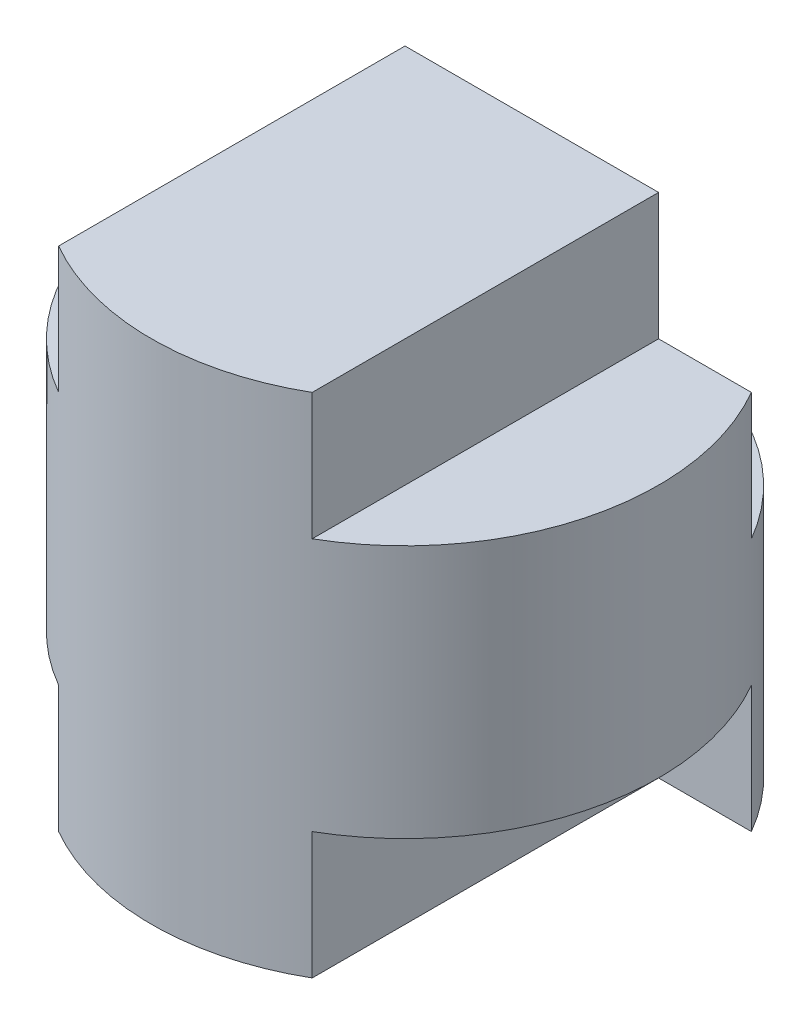
ISO-10303-21;
HEADER;
FILE_DESCRIPTION(('STEP AP214'),'2;1');
FILE_NAME('part.step','',(''),(''),'','','');
FILE_SCHEMA(('AUTOMOTIVE_DESIGN { 1 0 10303 214 1 1 1 1 }'));
ENDSEC;
DATA;
#1=APPLICATION_CONTEXT('core data for automotive mechanical design processes');
#2=APPLICATION_PROTOCOL_DEFINITION('international standard','automotive_design',2000,#1);
#3=PRODUCT_CONTEXT('',#1,'mechanical');
#4=PRODUCT('Part','Part','',(#3));
#5=PRODUCT_RELATED_PRODUCT_CATEGORY('part','',(#4));
#6=PRODUCT_DEFINITION_FORMATION('','',#4);
#7=PRODUCT_DEFINITION_CONTEXT('part definition',#1,'design');
#8=PRODUCT_DEFINITION('design','',#6,#7);
#9=PRODUCT_DEFINITION_SHAPE('','',#8);
#10=(LENGTH_UNIT() NAMED_UNIT(*) SI_UNIT(.MILLI.,.METRE.));
#11=(NAMED_UNIT(*) PLANE_ANGLE_UNIT() SI_UNIT($,.RADIAN.));
#12=(NAMED_UNIT(*) SI_UNIT($,.STERADIAN.) SOLID_ANGLE_UNIT());
#13=UNCERTAINTY_MEASURE_WITH_UNIT(LENGTH_MEASURE(1.E-05),#10,'distance_accuracy_value','');
#14=(GEOMETRIC_REPRESENTATION_CONTEXT(3) GLOBAL_UNCERTAINTY_ASSIGNED_CONTEXT((#13)) GLOBAL_UNIT_ASSIGNED_CONTEXT((#10,
#11,#12)) REPRESENTATION_CONTEXT('',''));
#15=CARTESIAN_POINT('',(0.,0.,0.));
#16=DIRECTION('',(0.,0.,1.));
#17=DIRECTION('',(1.,0.,0.));
#18=AXIS2_PLACEMENT_3D('',#15,#16,#17);
#19=CARTESIAN_POINT('',(0.,4.,0.));
#20=DIRECTION('',(0.,-1.,0.));
#21=DIRECTION('',(0.,0.,-1.));
#22=AXIS2_PLACEMENT_3D('',#19,#20,#21);
#23=CYLINDRICAL_SURFACE('',#22,2.);
#24=CARTESIAN_POINT('',(0.,3.,0.));
#25=DIRECTION('',(0.,1.,0.));
#26=DIRECTION('',(0.,0.,1.));
#27=AXIS2_PLACEMENT_3D('',#24,#25,#26);
#28=CIRCLE('',#27,2.);
#29=CARTESIAN_POINT('',(-1.73205080756888,3.,-1.));
#30=VERTEX_POINT('',#29);
#31=CARTESIAN_POINT('',(-1.,3.,1.73205080756888));
#32=VERTEX_POINT('',#31);
#33=EDGE_CURVE('E11',#30,#32,#28,.T.);
#34=ORIENTED_EDGE('',*,*,#33,.F.);
#35=DIRECTION('',(0.,1.,0.));
#36=VECTOR('',#35,1.);
#37=CARTESIAN_POINT('',(-1.73205080756888,2.,-1.));
#38=LINE('',#37,#36);
#39=CARTESIAN_POINT('',(-1.73205080756888,2.,-1.));
#40=VERTEX_POINT('',#39);
#41=EDGE_CURVE('E133',#40,#30,#38,.T.);
#42=ORIENTED_EDGE('',*,*,#41,.F.);
#43=CARTESIAN_POINT('',(0.,2.,0.));
#44=DIRECTION('',(0.,1.,0.));
#45=DIRECTION('',(0.,0.,-1.));
#46=AXIS2_PLACEMENT_3D('',#43,#44,#45);
#47=CIRCLE('',#46,2.);
#48=CARTESIAN_POINT('',(1.73205080756888,2.,-1.));
#49=VERTEX_POINT('',#48);
#50=EDGE_CURVE('E122',#49,#40,#47,.T.);
#51=ORIENTED_EDGE('',*,*,#50,.F.);
#52=DIRECTION('',(0.,1.,0.));
#53=VECTOR('',#52,1.);
#54=CARTESIAN_POINT('',(1.73205080756888,2.,-1.));
#55=LINE('',#54,#53);
#56=CARTESIAN_POINT('',(1.73205080756888,3.,-1.));
#57=VERTEX_POINT('',#56);
#58=EDGE_CURVE('E135',#49,#57,#55,.T.);
#59=ORIENTED_EDGE('',*,*,#58,.T.);
#60=CARTESIAN_POINT('',(0.,3.,0.));
#61=DIRECTION('',(0.,-1.,0.));
#62=DIRECTION('',(0.,0.,-1.));
#63=AXIS2_PLACEMENT_3D('',#60,#61,#62);
#64=CIRCLE('',#63,2.);
#65=CARTESIAN_POINT('',(1.,3.,1.73205080756888));
#66=VERTEX_POINT('',#65);
#67=EDGE_CURVE('E40',#57,#66,#64,.T.);
#68=ORIENTED_EDGE('',*,*,#67,.T.);
#69=DIRECTION('',(0.,-1.,0.));
#70=VECTOR('',#69,1.);
#71=CARTESIAN_POINT('',(1.,4.,1.73205080756888));
#72=LINE('',#71,#70);
#73=CARTESIAN_POINT('',(1.,4.,1.73205080756888));
#74=VERTEX_POINT('',#73);
#75=EDGE_CURVE('E182',#74,#66,#72,.T.);
#76=ORIENTED_EDGE('',*,*,#75,.F.);
#77=CARTESIAN_POINT('',(0.,4.,0.));
#78=DIRECTION('',(0.,1.,0.));
#79=DIRECTION('',(0.,0.,1.));
#80=AXIS2_PLACEMENT_3D('',#77,#78,#79);
#81=CIRCLE('',#80,2.);
#82=CARTESIAN_POINT('',(-1.,4.,1.73205080756888));
#83=VERTEX_POINT('',#82);
#84=EDGE_CURVE('E188',#83,#74,#81,.T.);
#85=ORIENTED_EDGE('',*,*,#84,.F.);
#86=DIRECTION('',(0.,-1.,0.));
#87=VECTOR('',#86,1.);
#88=CARTESIAN_POINT('',(-1.,4.,1.73205080756888));
#89=LINE('',#88,#87);
#90=EDGE_CURVE('E185',#83,#32,#89,.T.);
#91=ORIENTED_EDGE('',*,*,#90,.T.);
#92=EDGE_LOOP('',(#34,#42,#51,#59,#68,#76,#85,#91));
#93=FACE_BOUND('',#92,.T.);
#94=CARTESIAN_POINT('',(0.,0.,0.));
#95=DIRECTION('',(0.,1.,0.));
#96=DIRECTION('',(0.,0.,1.));
#97=AXIS2_PLACEMENT_3D('',#94,#95,#96);
#98=CIRCLE('',#97,2.);
#99=CARTESIAN_POINT('',(-1.,0.,1.73205080756888));
#100=VERTEX_POINT('',#99);
#101=CARTESIAN_POINT('',(1.,0.,1.73205080756888));
#102=VERTEX_POINT('',#101);
#103=EDGE_CURVE('E187',#100,#102,#98,.T.);
#104=ORIENTED_EDGE('',*,*,#103,.T.);
#105=DIRECTION('',(0.,-1.,0.));
#106=VECTOR('',#105,1.);
#107=CARTESIAN_POINT('',(1.,4.,1.73205080756888));
#108=LINE('',#107,#106);
#109=CARTESIAN_POINT('',(1.,1.,1.73205080756888));
#110=VERTEX_POINT('',#109);
#111=EDGE_CURVE('E179',#102,#110,#108,.F.);
#112=ORIENTED_EDGE('',*,*,#111,.T.);
#113=CARTESIAN_POINT('',(0.,1.,0.));
#114=DIRECTION('',(0.,-1.,0.));
#115=DIRECTION('',(0.,0.,-1.));
#116=AXIS2_PLACEMENT_3D('',#113,#114,#115);
#117=CIRCLE('',#116,2.);
#118=CARTESIAN_POINT('',(1.73205080756888,1.,-1.));
#119=VERTEX_POINT('',#118);
#120=EDGE_CURVE('E211',#119,#110,#117,.T.);
#121=ORIENTED_EDGE('',*,*,#120,.F.);
#122=DIRECTION('',(0.,-1.,0.));
#123=VECTOR('',#122,1.);
#124=CARTESIAN_POINT('',(1.73205080756888,4.,-1.));
#125=LINE('',#124,#123);
#126=CARTESIAN_POINT('',(1.73205080756888,0.,-1.));
#127=VERTEX_POINT('',#126);
#128=EDGE_CURVE('E177',#127,#119,#125,.F.);
#129=ORIENTED_EDGE('',*,*,#128,.F.);
#130=CARTESIAN_POINT('',(-1.73205080756888,0.,-1.));
#131=VERTEX_POINT('',#130);
#132=EDGE_CURVE('E192',#127,#131,#98,.T.);
#133=ORIENTED_EDGE('',*,*,#132,.T.);
#134=DIRECTION('',(0.,-1.,0.));
#135=VECTOR('',#134,1.);
#136=CARTESIAN_POINT('',(-1.73205080756888,4.,-1.));
#137=LINE('',#136,#135);
#138=CARTESIAN_POINT('',(-1.73205080756888,1.,-1.));
#139=VERTEX_POINT('',#138);
#140=EDGE_CURVE('E55',#139,#131,#137,.T.);
#141=ORIENTED_EDGE('',*,*,#140,.F.);
#142=CARTESIAN_POINT('',(0.,1.,0.));
#143=DIRECTION('',(0.,1.,0.));
#144=DIRECTION('',(0.,0.,1.));
#145=AXIS2_PLACEMENT_3D('',#142,#143,#144);
#146=CIRCLE('',#145,2.);
#147=CARTESIAN_POINT('',(-1.,1.,1.73205080756888));
#148=VERTEX_POINT('',#147);
#149=EDGE_CURVE('E209',#139,#148,#146,.T.);
#150=ORIENTED_EDGE('',*,*,#149,.T.);
#151=DIRECTION('',(0.,-1.,0.));
#152=VECTOR('',#151,1.);
#153=CARTESIAN_POINT('',(-1.,4.,1.73205080756888));
#154=LINE('',#153,#152);
#155=EDGE_CURVE('E174',#100,#148,#154,.F.);
#156=ORIENTED_EDGE('',*,*,#155,.F.);
#157=EDGE_LOOP('',(#104,#112,#121,#129,#133,#141,#150,#156));
#158=FACE_BOUND('',#157,.T.);
#159=ADVANCED_FACE('F33',(#93,#158),#23,.T.);
#160=CARTESIAN_POINT('',(0.,4.,0.));
#161=DIRECTION('',(0.,1.,0.));
#162=DIRECTION('',(0.,0.,1.));
#163=AXIS2_PLACEMENT_3D('',#160,#161,#162);
#164=PLANE('',#163);
#165=DIRECTION('',(1.,0.,0.));
#166=VECTOR('',#165,1.);
#167=CARTESIAN_POINT('',(-1.73205080756888,4.,-1.));
#168=LINE('',#167,#166);
#169=CARTESIAN_POINT('',(-1.,4.,-1.));
#170=VERTEX_POINT('',#169);
#171=CARTESIAN_POINT('',(0.999999999999999,4.,-1.));
#172=VERTEX_POINT('',#171);
#173=EDGE_CURVE('E129',#170,#172,#168,.T.);
#174=ORIENTED_EDGE('',*,*,#173,.F.);
#175=DIRECTION('',(0.,0.,-1.));
#176=VECTOR('',#175,1.);
#177=CARTESIAN_POINT('',(-1.,4.,0.));
#178=LINE('',#177,#176);
#179=EDGE_CURVE('E206',#83,#170,#178,.T.);
#180=ORIENTED_EDGE('',*,*,#179,.F.);
#181=ORIENTED_EDGE('',*,*,#84,.T.);
#182=DIRECTION('',(0.,0.,-1.));
#183=VECTOR('',#182,1.);
#184=CARTESIAN_POINT('',(1.,4.,0.));
#185=LINE('',#184,#183);
#186=EDGE_CURVE('E203',#74,#172,#185,.T.);
#187=ORIENTED_EDGE('',*,*,#186,.T.);
#188=EDGE_LOOP('',(#174,#180,#181,#187));
#189=FACE_BOUND('',#188,.T.);
#190=ADVANCED_FACE('F223',(#189),#164,.T.);
#191=CARTESIAN_POINT('',(0.,0.,0.));
#192=DIRECTION('',(0.,1.,0.));
#193=DIRECTION('',(0.,0.,1.));
#194=AXIS2_PLACEMENT_3D('',#191,#192,#193);
#195=PLANE('',#194);
#196=DIRECTION('',(1.,0.,0.));
#197=VECTOR('',#196,1.);
#198=CARTESIAN_POINT('',(0.,0.,-1.));
#199=LINE('',#198,#197);
#200=CARTESIAN_POINT('',(1.,0.,-1.));
#201=VERTEX_POINT('',#200);
#202=EDGE_CURVE('E198',#201,#127,#199,.T.);
#203=ORIENTED_EDGE('',*,*,#202,.F.);
#204=DIRECTION('',(0.,0.,1.));
#205=VECTOR('',#204,1.);
#206=CARTESIAN_POINT('',(1.,0.,0.));
#207=LINE('',#206,#205);
#208=EDGE_CURVE('E200',#201,#102,#207,.T.);
#209=ORIENTED_EDGE('',*,*,#208,.T.);
#210=ORIENTED_EDGE('',*,*,#103,.F.);
#211=DIRECTION('',(0.,0.,1.));
#212=VECTOR('',#211,1.);
#213=CARTESIAN_POINT('',(-1.,0.,0.));
#214=LINE('',#213,#212);
#215=CARTESIAN_POINT('',(-1.,0.,-1.));
#216=VERTEX_POINT('',#215);
#217=EDGE_CURVE('E196',#216,#100,#214,.T.);
#218=ORIENTED_EDGE('',*,*,#217,.F.);
#219=DIRECTION('',(1.,0.,0.));
#220=VECTOR('',#219,1.);
#221=CARTESIAN_POINT('',(0.,0.,-1.));
#222=LINE('',#221,#220);
#223=EDGE_CURVE('E191',#131,#216,#222,.T.);
#224=ORIENTED_EDGE('',*,*,#223,.F.);
#225=ORIENTED_EDGE('',*,*,#132,.F.);
#226=EDGE_LOOP('',(#203,#209,#210,#218,#224,#225));
#227=FACE_BOUND('',#226,.T.);
#228=ADVANCED_FACE('F243',(#227),#195,.F.);
#229=CARTESIAN_POINT('',(0.,1.,4.));
#230=DIRECTION('',(0.,1.,0.));
#231=DIRECTION('',(0.,0.,1.));
#232=AXIS2_PLACEMENT_3D('',#229,#230,#231);
#233=PLANE('',#232);
#234=DIRECTION('',(1.,0.,0.));
#235=VECTOR('',#234,1.);
#236=CARTESIAN_POINT('',(0.,1.,-1.));
#237=LINE('',#236,#235);
#238=CARTESIAN_POINT('',(-1.,1.,-1.));
#239=VERTEX_POINT('',#238);
#240=EDGE_CURVE('E168',#139,#239,#237,.T.);
#241=ORIENTED_EDGE('',*,*,#240,.T.);
#242=DIRECTION('',(0.,0.,-1.));
#243=VECTOR('',#242,1.);
#244=CARTESIAN_POINT('',(-1.,1.,4.));
#245=LINE('',#244,#243);
#246=EDGE_CURVE('E171',#148,#239,#245,.T.);
#247=ORIENTED_EDGE('',*,*,#246,.F.);
#248=ORIENTED_EDGE('',*,*,#149,.F.);
#249=EDGE_LOOP('',(#241,#247,#248));
#250=FACE_BOUND('',#249,.T.);
#251=ADVANCED_FACE('F248',(#250),#233,.F.);
#252=CARTESIAN_POINT('',(-1.,0.,4.));
#253=DIRECTION('',(-1.,0.,0.));
#254=DIRECTION('',(0.,0.,1.));
#255=AXIS2_PLACEMENT_3D('',#252,#253,#254);
#256=PLANE('',#255);
#257=ORIENTED_EDGE('',*,*,#155,.T.);
#258=ORIENTED_EDGE('',*,*,#246,.T.);
#259=DIRECTION('',(0.,1.,0.));
#260=VECTOR('',#259,1.);
#261=CARTESIAN_POINT('',(-1.,0.,-1.));
#262=LINE('',#261,#260);
#263=EDGE_CURVE('E151',#216,#239,#262,.T.);
#264=ORIENTED_EDGE('',*,*,#263,.F.);
#265=ORIENTED_EDGE('',*,*,#217,.T.);
#266=EDGE_LOOP('',(#257,#258,#264,#265));
#267=FACE_BOUND('',#266,.T.);
#268=ADVANCED_FACE('F251',(#267),#256,.T.);
#269=CARTESIAN_POINT('',(0.,0.,-1.));
#270=DIRECTION('',(0.,0.,1.));
#271=DIRECTION('',(1.,0.,0.));
#272=AXIS2_PLACEMENT_3D('',#269,#270,#271);
#273=PLANE('',#272);
#274=ORIENTED_EDGE('',*,*,#140,.T.);
#275=ORIENTED_EDGE('',*,*,#223,.T.);
#276=ORIENTED_EDGE('',*,*,#263,.T.);
#277=ORIENTED_EDGE('',*,*,#240,.F.);
#278=EDGE_LOOP('',(#274,#275,#276,#277));
#279=FACE_BOUND('',#278,.T.);
#280=ADVANCED_FACE('F254',(#279),#273,.T.);
#281=CARTESIAN_POINT('',(0.,1.,4.));
#282=DIRECTION('',(0.,-1.,0.));
#283=DIRECTION('',(0.,0.,-1.));
#284=AXIS2_PLACEMENT_3D('',#281,#282,#283);
#285=PLANE('',#284);
#286=ORIENTED_EDGE('',*,*,#120,.T.);
#287=DIRECTION('',(0.,0.,-1.));
#288=VECTOR('',#287,1.);
#289=CARTESIAN_POINT('',(1.,1.,4.));
#290=LINE('',#289,#288);
#291=CARTESIAN_POINT('',(1.,1.,-1.));
#292=VERTEX_POINT('',#291);
#293=EDGE_CURVE('E145',#110,#292,#290,.T.);
#294=ORIENTED_EDGE('',*,*,#293,.T.);
#295=DIRECTION('',(-1.,0.,0.));
#296=VECTOR('',#295,1.);
#297=CARTESIAN_POINT('',(0.,1.,-1.));
#298=LINE('',#297,#296);
#299=EDGE_CURVE('E147',#119,#292,#298,.T.);
#300=ORIENTED_EDGE('',*,*,#299,.F.);
#301=EDGE_LOOP('',(#286,#294,#300));
#302=FACE_BOUND('',#301,.T.);
#303=ADVANCED_FACE('F260',(#302),#285,.T.);
#304=CARTESIAN_POINT('',(1.,0.,4.));
#305=DIRECTION('',(-1.,0.,0.));
#306=DIRECTION('',(0.,0.,1.));
#307=AXIS2_PLACEMENT_3D('',#304,#305,#306);
#308=PLANE('',#307);
#309=ORIENTED_EDGE('',*,*,#208,.F.);
#310=DIRECTION('',(0.,1.,0.));
#311=VECTOR('',#310,1.);
#312=CARTESIAN_POINT('',(1.,0.,-1.));
#313=LINE('',#312,#311);
#314=EDGE_CURVE('E47',#201,#292,#313,.T.);
#315=ORIENTED_EDGE('',*,*,#314,.T.);
#316=ORIENTED_EDGE('',*,*,#293,.F.);
#317=ORIENTED_EDGE('',*,*,#111,.F.);
#318=EDGE_LOOP('',(#309,#315,#316,#317));
#319=FACE_BOUND('',#318,.T.);
#320=ADVANCED_FACE('F264',(#319),#308,.F.);
#321=CARTESIAN_POINT('',(0.,0.,-1.));
#322=DIRECTION('',(0.,0.,1.));
#323=DIRECTION('',(1.,0.,0.));
#324=AXIS2_PLACEMENT_3D('',#321,#322,#323);
#325=PLANE('',#324);
#326=ORIENTED_EDGE('',*,*,#128,.T.);
#327=ORIENTED_EDGE('',*,*,#299,.T.);
#328=ORIENTED_EDGE('',*,*,#314,.F.);
#329=ORIENTED_EDGE('',*,*,#202,.T.);
#330=EDGE_LOOP('',(#326,#327,#328,#329));
#331=FACE_BOUND('',#330,.T.);
#332=ADVANCED_FACE('F270',(#331),#325,.T.);
#333=CARTESIAN_POINT('',(0.,3.,4.));
#334=DIRECTION('',(0.,-1.,0.));
#335=DIRECTION('',(0.,0.,-1.));
#336=AXIS2_PLACEMENT_3D('',#333,#334,#335);
#337=PLANE('',#336);
#338=DIRECTION('',(-1.,0.,0.));
#339=VECTOR('',#338,1.);
#340=CARTESIAN_POINT('',(0.,3.,-1.));
#341=LINE('',#340,#339);
#342=CARTESIAN_POINT('',(1.,3.,-1.));
#343=VERTEX_POINT('',#342);
#344=EDGE_CURVE('E155',#57,#343,#341,.T.);
#345=ORIENTED_EDGE('',*,*,#344,.T.);
#346=DIRECTION('',(0.,0.,-1.));
#347=VECTOR('',#346,1.);
#348=CARTESIAN_POINT('',(1.,3.,4.));
#349=LINE('',#348,#347);
#350=EDGE_CURVE('E152',#66,#343,#349,.T.);
#351=ORIENTED_EDGE('',*,*,#350,.F.);
#352=ORIENTED_EDGE('',*,*,#67,.F.);
#353=EDGE_LOOP('',(#345,#351,#352));
#354=FACE_BOUND('',#353,.T.);
#355=ADVANCED_FACE('F220',(#354),#337,.F.);
#356=CARTESIAN_POINT('',(1.,0.,4.));
#357=DIRECTION('',(1.,0.,0.));
#358=DIRECTION('',(0.,1.,0.));
#359=AXIS2_PLACEMENT_3D('',#356,#357,#358);
#360=PLANE('',#359);
#361=ORIENTED_EDGE('',*,*,#75,.T.);
#362=ORIENTED_EDGE('',*,*,#350,.T.);
#363=DIRECTION('',(0.,-1.,0.));
#364=VECTOR('',#363,1.);
#365=CARTESIAN_POINT('',(1.,0.,-1.));
#366=LINE('',#365,#364);
#367=EDGE_CURVE('E148',#172,#343,#366,.T.);
#368=ORIENTED_EDGE('',*,*,#367,.F.);
#369=ORIENTED_EDGE('',*,*,#186,.F.);
#370=EDGE_LOOP('',(#361,#362,#368,#369));
#371=FACE_BOUND('',#370,.T.);
#372=ADVANCED_FACE('F218',(#371),#360,.T.);
#373=CARTESIAN_POINT('',(-2.,3.,4.));
#374=DIRECTION('',(0.,1.,0.));
#375=DIRECTION('',(0.,0.,1.));
#376=AXIS2_PLACEMENT_3D('',#373,#374,#375);
#377=PLANE('',#376);
#378=ORIENTED_EDGE('',*,*,#33,.T.);
#379=DIRECTION('',(0.,0.,-1.));
#380=VECTOR('',#379,1.);
#381=CARTESIAN_POINT('',(-1.,3.,4.));
#382=LINE('',#381,#380);
#383=CARTESIAN_POINT('',(-1.,3.,-1.));
#384=VERTEX_POINT('',#383);
#385=EDGE_CURVE('E141',#32,#384,#382,.T.);
#386=ORIENTED_EDGE('',*,*,#385,.T.);
#387=DIRECTION('',(1.,0.,0.));
#388=VECTOR('',#387,1.);
#389=CARTESIAN_POINT('',(-2.,3.,-1.));
#390=LINE('',#389,#388);
#391=EDGE_CURVE('E156',#30,#384,#390,.T.);
#392=ORIENTED_EDGE('',*,*,#391,.F.);
#393=EDGE_LOOP('',(#378,#386,#392));
#394=FACE_BOUND('',#393,.T.);
#395=ADVANCED_FACE('F229',(#394),#377,.T.);
#396=CARTESIAN_POINT('',(-1.,4.,4.));
#397=DIRECTION('',(1.,0.,0.));
#398=DIRECTION('',(0.,1.,0.));
#399=AXIS2_PLACEMENT_3D('',#396,#397,#398);
#400=PLANE('',#399);
#401=ORIENTED_EDGE('',*,*,#179,.T.);
#402=DIRECTION('',(0.,-1.,0.));
#403=VECTOR('',#402,1.);
#404=CARTESIAN_POINT('',(-1.,4.,-1.));
#405=LINE('',#404,#403);
#406=EDGE_CURVE('E162',#170,#384,#405,.T.);
#407=ORIENTED_EDGE('',*,*,#406,.T.);
#408=ORIENTED_EDGE('',*,*,#385,.F.);
#409=ORIENTED_EDGE('',*,*,#90,.F.);
#410=EDGE_LOOP('',(#401,#407,#408,#409));
#411=FACE_BOUND('',#410,.T.);
#412=ADVANCED_FACE('F227',(#411),#400,.F.);
#413=CARTESIAN_POINT('',(-1.73205080756888,2.,-1.));
#414=DIRECTION('',(0.,0.,1.));
#415=DIRECTION('',(1.,0.,0.));
#416=AXIS2_PLACEMENT_3D('',#413,#414,#415);
#417=PLANE('',#416);
#418=ORIENTED_EDGE('',*,*,#58,.F.);
#419=DIRECTION('',(1.,0.,0.));
#420=VECTOR('',#419,1.);
#421=CARTESIAN_POINT('',(-1.73205080756888,2.,-1.));
#422=LINE('',#421,#420);
#423=EDGE_CURVE('E125',#40,#49,#422,.T.);
#424=ORIENTED_EDGE('',*,*,#423,.F.);
#425=ORIENTED_EDGE('',*,*,#41,.T.);
#426=ORIENTED_EDGE('',*,*,#391,.T.);
#427=ORIENTED_EDGE('',*,*,#406,.F.);
#428=ORIENTED_EDGE('',*,*,#173,.T.);
#429=ORIENTED_EDGE('',*,*,#367,.T.);
#430=ORIENTED_EDGE('',*,*,#344,.F.);
#431=EDGE_LOOP('',(#418,#424,#425,#426,#427,#428,#429,#430));
#432=FACE_BOUND('',#431,.T.);
#433=ADVANCED_FACE('F132',(#432),#417,.F.);
#434=CARTESIAN_POINT('',(0.,2.,0.));
#435=DIRECTION('',(0.,-1.,0.));
#436=DIRECTION('',(0.,0.,-1.));
#437=AXIS2_PLACEMENT_3D('',#434,#435,#436);
#438=PLANE('',#437);
#439=ORIENTED_EDGE('',*,*,#50,.T.);
#440=ORIENTED_EDGE('',*,*,#423,.T.);
#441=EDGE_LOOP('',(#439,#440));
#442=FACE_BOUND('',#441,.T.);
#443=ADVANCED_FACE('F124',(#442),#438,.F.);
#444=CLOSED_SHELL('',(#159,#190,#228,#251,#268,#280,#303,#320,#332,#355,#372,#395,#412,#433,#443));
#445=MANIFOLD_SOLID_BREP('B2',#444);
#446=ADVANCED_BREP_SHAPE_REPRESENTATION('',(#18,#445),#14);
#447=SHAPE_DEFINITION_REPRESENTATION(#9,#446);
ENDSEC;
END-ISO-10303-21;
